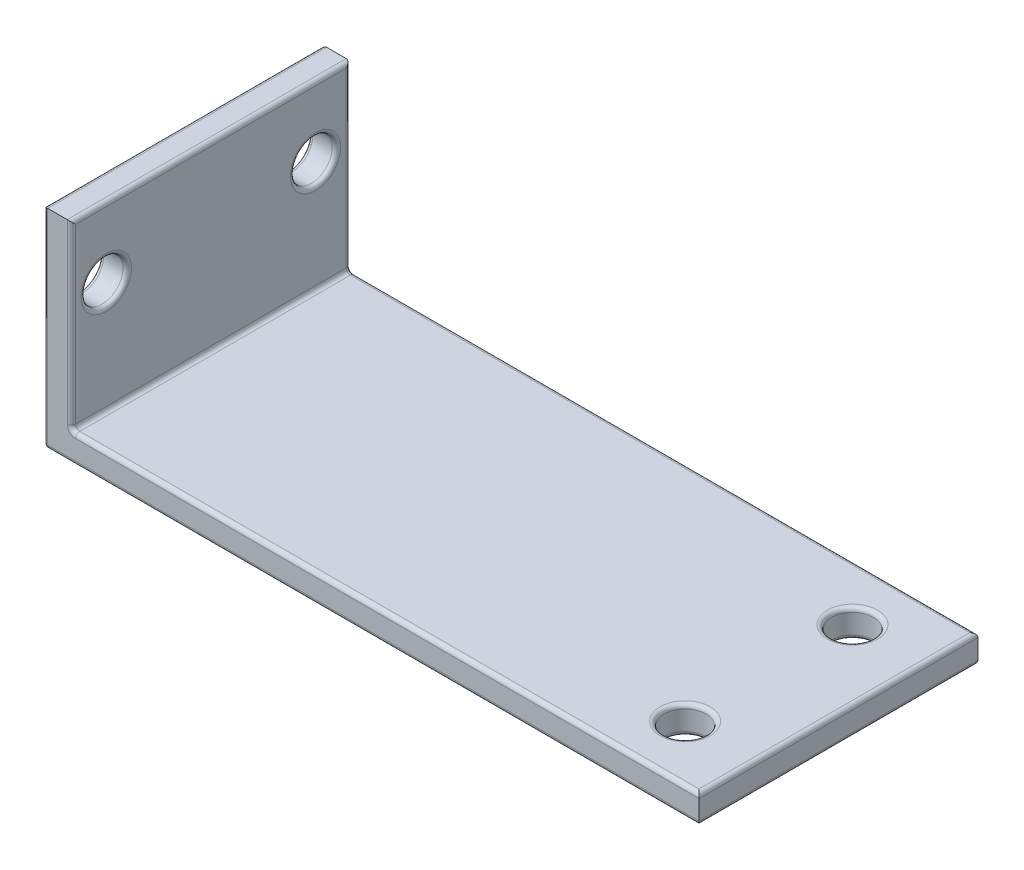
ISO-10303-21;
HEADER;
FILE_DESCRIPTION(('STEP AP214'),'2;1');
FILE_NAME('part.step','',(''),(''),'','','');
FILE_SCHEMA(('AUTOMOTIVE_DESIGN { 1 0 10303 214 1 1 1 1 }'));
ENDSEC;
DATA;
#1=APPLICATION_CONTEXT('core data for automotive mechanical design processes');
#2=APPLICATION_PROTOCOL_DEFINITION('international standard','automotive_design',2000,#1);
#3=PRODUCT_CONTEXT('',#1,'mechanical');
#4=PRODUCT('Part','Part','',(#3));
#5=PRODUCT_RELATED_PRODUCT_CATEGORY('part','',(#4));
#6=PRODUCT_DEFINITION_FORMATION('','',#4);
#7=PRODUCT_DEFINITION_CONTEXT('part definition',#1,'design');
#8=PRODUCT_DEFINITION('design','',#6,#7);
#9=PRODUCT_DEFINITION_SHAPE('','',#8);
#10=(LENGTH_UNIT() NAMED_UNIT(*) SI_UNIT(.MILLI.,.METRE.));
#11=(NAMED_UNIT(*) PLANE_ANGLE_UNIT() SI_UNIT($,.RADIAN.));
#12=(NAMED_UNIT(*) SI_UNIT($,.STERADIAN.) SOLID_ANGLE_UNIT());
#13=UNCERTAINTY_MEASURE_WITH_UNIT(LENGTH_MEASURE(1.E-05),#10,'distance_accuracy_value','');
#14=(GEOMETRIC_REPRESENTATION_CONTEXT(3) GLOBAL_UNCERTAINTY_ASSIGNED_CONTEXT((#13)) GLOBAL_UNIT_ASSIGNED_CONTEXT((#10,
#11,#12)) REPRESENTATION_CONTEXT('',''));
#15=CARTESIAN_POINT('',(0.,0.,0.));
#16=DIRECTION('',(0.,0.,1.));
#17=DIRECTION('',(1.,0.,0.));
#18=AXIS2_PLACEMENT_3D('',#15,#16,#17);
#19=CARTESIAN_POINT('',(0.,15.,10.));
#20=DIRECTION('',(1.,0.,0.));
#21=DIRECTION('',(0.,0.,-1.));
#22=AXIS2_PLACEMENT_3D('',#19,#20,#21);
#23=PLANE('',#22);
#24=DIRECTION('',(0.,-1.,0.));
#25=VECTOR('',#24,1.);
#26=CARTESIAN_POINT('',(0.,15.,9.7));
#27=LINE('',#26,#25);
#28=CARTESIAN_POINT('',(0.,0.3,9.7));
#29=VERTEX_POINT('',#28);
#30=CARTESIAN_POINT('',(0.,14.7,9.7));
#31=VERTEX_POINT('',#30);
#32=EDGE_CURVE('E42',#29,#31,#27,.F.);
#33=ORIENTED_EDGE('',*,*,#32,.T.);
#34=DIRECTION('',(0.,0.,-1.));
#35=VECTOR('',#34,1.);
#36=CARTESIAN_POINT('',(0.,14.7,10.));
#37=LINE('',#36,#35);
#38=CARTESIAN_POINT('',(0.,14.7,-9.7));
#39=VERTEX_POINT('',#38);
#40=EDGE_CURVE('E11',#31,#39,#37,.T.);
#41=ORIENTED_EDGE('',*,*,#40,.T.);
#42=DIRECTION('',(0.,-1.,0.));
#43=VECTOR('',#42,1.);
#44=CARTESIAN_POINT('',(0.,15.,-9.7));
#45=LINE('',#44,#43);
#46=CARTESIAN_POINT('',(0.,0.3,-9.7));
#47=VERTEX_POINT('',#46);
#48=EDGE_CURVE('E282',#39,#47,#45,.T.);
#49=ORIENTED_EDGE('',*,*,#48,.T.);
#50=DIRECTION('',(0.,0.,-1.));
#51=VECTOR('',#50,1.);
#52=CARTESIAN_POINT('',(0.,0.3,10.));
#53=LINE('',#52,#51);
#54=EDGE_CURVE('E53',#47,#29,#53,.F.);
#55=ORIENTED_EDGE('',*,*,#54,.T.);
#56=EDGE_LOOP('',(#33,#41,#49,#55));
#57=FACE_BOUND('',#56,.T.);
#58=CARTESIAN_POINT('',(0.,10.,-7.50000000000007));
#59=DIRECTION('',(1.,0.,0.));
#60=DIRECTION('',(0.,0.,-1.));
#61=AXIS2_PLACEMENT_3D('',#58,#59,#60);
#62=CIRCLE('',#61,1.80000000000001);
#63=CARTESIAN_POINT('',(0.,10.,-9.30000000000007));
#64=VERTEX_POINT('',#63);
#65=EDGE_CURVE('E279',#64,#64,#62,.T.);
#66=ORIENTED_EDGE('',*,*,#65,.T.);
#67=EDGE_LOOP('',(#66));
#68=FACE_BOUND('',#67,.T.);
#69=CARTESIAN_POINT('',(0.,10.,7.5));
#70=DIRECTION('',(1.,0.,0.));
#71=DIRECTION('',(0.,0.,-1.));
#72=AXIS2_PLACEMENT_3D('',#69,#70,#71);
#73=CIRCLE('',#72,1.8);
#74=CARTESIAN_POINT('',(0.,10.,5.7));
#75=VERTEX_POINT('',#74);
#76=EDGE_CURVE('E276',#75,#75,#73,.T.);
#77=ORIENTED_EDGE('',*,*,#76,.T.);
#78=EDGE_LOOP('',(#77));
#79=FACE_BOUND('',#78,.T.);
#80=ADVANCED_FACE('F33',(#57,#68,#79),#23,.F.);
#81=CARTESIAN_POINT('',(0.,0.,10.));
#82=DIRECTION('',(0.,1.,0.));
#83=DIRECTION('',(0.,0.,1.));
#84=AXIS2_PLACEMENT_3D('',#81,#82,#83);
#85=PLANE('',#84);
#86=CARTESIAN_POINT('',(42.,0.,-6.));
#87=DIRECTION('',(0.,1.,0.));
#88=DIRECTION('',(0.,0.,1.));
#89=AXIS2_PLACEMENT_3D('',#86,#87,#88);
#90=CIRCLE('',#89,1.8);
#91=CARTESIAN_POINT('',(42.,0.,-4.2));
#92=VERTEX_POINT('',#91);
#93=EDGE_CURVE('E273',#92,#92,#90,.T.);
#94=ORIENTED_EDGE('',*,*,#93,.T.);
#95=EDGE_LOOP('',(#94));
#96=FACE_BOUND('',#95,.T.);
#97=CARTESIAN_POINT('',(42.,0.,6.));
#98=DIRECTION('',(0.,1.,0.));
#99=DIRECTION('',(0.,0.,1.));
#100=AXIS2_PLACEMENT_3D('',#97,#98,#99);
#101=CIRCLE('',#100,1.8);
#102=CARTESIAN_POINT('',(42.,0.,7.8));
#103=VERTEX_POINT('',#102);
#104=EDGE_CURVE('E270',#103,#103,#101,.T.);
#105=ORIENTED_EDGE('',*,*,#104,.T.);
#106=EDGE_LOOP('',(#105));
#107=FACE_BOUND('',#106,.T.);
#108=DIRECTION('',(0.,0.,-1.));
#109=VECTOR('',#108,1.);
#110=CARTESIAN_POINT('',(46.7,0.,10.));
#111=LINE('',#110,#109);
#112=CARTESIAN_POINT('',(46.7,0.,-9.7));
#113=VERTEX_POINT('',#112);
#114=CARTESIAN_POINT('',(46.7,0.,9.7));
#115=VERTEX_POINT('',#114);
#116=EDGE_CURVE('E267',#113,#115,#111,.F.);
#117=ORIENTED_EDGE('',*,*,#116,.T.);
#118=DIRECTION('',(1.,0.,0.));
#119=VECTOR('',#118,1.);
#120=CARTESIAN_POINT('',(0.,0.,9.7));
#121=LINE('',#120,#119);
#122=CARTESIAN_POINT('',(0.3,0.,9.7));
#123=VERTEX_POINT('',#122);
#124=EDGE_CURVE('E146',#115,#123,#121,.F.);
#125=ORIENTED_EDGE('',*,*,#124,.T.);
#126=DIRECTION('',(0.,0.,-1.));
#127=VECTOR('',#126,1.);
#128=CARTESIAN_POINT('',(0.3,0.,10.));
#129=LINE('',#128,#127);
#130=CARTESIAN_POINT('',(0.3,0.,-9.7));
#131=VERTEX_POINT('',#130);
#132=EDGE_CURVE('E263',#123,#131,#129,.T.);
#133=ORIENTED_EDGE('',*,*,#132,.T.);
#134=DIRECTION('',(1.,0.,0.));
#135=VECTOR('',#134,1.);
#136=CARTESIAN_POINT('',(0.,0.,-9.7));
#137=LINE('',#136,#135);
#138=EDGE_CURVE('E265',#131,#113,#137,.T.);
#139=ORIENTED_EDGE('',*,*,#138,.T.);
#140=EDGE_LOOP('',(#117,#125,#133,#139));
#141=FACE_BOUND('',#140,.T.);
#142=ADVANCED_FACE('F345',(#96,#107,#141),#85,.F.);
#143=CARTESIAN_POINT('',(47.,0.,10.));
#144=DIRECTION('',(-1.,0.,0.));
#145=DIRECTION('',(0.,0.,1.));
#146=AXIS2_PLACEMENT_3D('',#143,#144,#145);
#147=PLANE('',#146);
#148=DIRECTION('',(0.,1.,0.));
#149=VECTOR('',#148,1.);
#150=CARTESIAN_POINT('',(47.,0.,-10.));
#151=LINE('',#150,#149);
#152=CARTESIAN_POINT('',(47.,0.3,-10.));
#153=VERTEX_POINT('',#152);
#154=CARTESIAN_POINT('',(47.,1.7,-10.));
#155=VERTEX_POINT('',#154);
#156=EDGE_CURVE('E181',#153,#155,#151,.T.);
#157=ORIENTED_EDGE('',*,*,#156,.T.);
#158=DIRECTION('',(0.,0.,-1.));
#159=VECTOR('',#158,1.);
#160=CARTESIAN_POINT('',(47.,1.7,10.));
#161=LINE('',#160,#159);
#162=CARTESIAN_POINT('',(47.,1.7,10.));
#163=VERTEX_POINT('',#162);
#164=EDGE_CURVE('E160',#155,#163,#161,.F.);
#165=ORIENTED_EDGE('',*,*,#164,.T.);
#166=DIRECTION('',(0.,1.,0.));
#167=VECTOR('',#166,1.);
#168=CARTESIAN_POINT('',(47.,0.,10.));
#169=LINE('',#168,#167);
#170=CARTESIAN_POINT('',(47.,0.3,10.));
#171=VERTEX_POINT('',#170);
#172=EDGE_CURVE('E166',#171,#163,#169,.T.);
#173=ORIENTED_EDGE('',*,*,#172,.F.);
#174=DIRECTION('',(0.,0.,-1.));
#175=VECTOR('',#174,1.);
#176=CARTESIAN_POINT('',(47.,0.3,10.));
#177=LINE('',#176,#175);
#178=EDGE_CURVE('E152',#171,#153,#177,.T.);
#179=ORIENTED_EDGE('',*,*,#178,.T.);
#180=EDGE_LOOP('',(#157,#165,#173,#179));
#181=FACE_BOUND('',#180,.T.);
#182=ADVANCED_FACE('F174',(#181),#147,.F.);
#183=CARTESIAN_POINT('',(47.,2.,10.));
#184=DIRECTION('',(0.,-1.,0.));
#185=DIRECTION('',(1.,0.,0.));
#186=AXIS2_PLACEMENT_3D('',#183,#184,#185);
#187=PLANE('',#186);
#188=DIRECTION('',(-1.,0.,0.));
#189=VECTOR('',#188,1.);
#190=CARTESIAN_POINT('',(47.,2.,9.7));
#191=LINE('',#190,#189);
#192=CARTESIAN_POINT('',(2.3,1.99999999999999,9.7));
#193=VERTEX_POINT('',#192);
#194=CARTESIAN_POINT('',(46.7,2.,9.7));
#195=VERTEX_POINT('',#194);
#196=EDGE_CURVE('E246',#193,#195,#191,.F.);
#197=ORIENTED_EDGE('',*,*,#196,.T.);
#198=DIRECTION('',(0.,0.,-1.));
#199=VECTOR('',#198,1.);
#200=CARTESIAN_POINT('',(46.7,2.,10.));
#201=LINE('',#200,#199);
#202=CARTESIAN_POINT('',(46.7,2.,-9.7));
#203=VERTEX_POINT('',#202);
#204=EDGE_CURVE('E161',#195,#203,#201,.T.);
#205=ORIENTED_EDGE('',*,*,#204,.T.);
#206=DIRECTION('',(-1.,0.,0.));
#207=VECTOR('',#206,1.);
#208=CARTESIAN_POINT('',(47.,2.,-9.7));
#209=LINE('',#208,#207);
#210=CARTESIAN_POINT('',(2.3,1.99999999999999,-9.7));
#211=VERTEX_POINT('',#210);
#212=EDGE_CURVE('E242',#203,#211,#209,.T.);
#213=ORIENTED_EDGE('',*,*,#212,.T.);
#214=DIRECTION('',(0.,0.,-1.));
#215=VECTOR('',#214,1.);
#216=CARTESIAN_POINT('',(2.3,1.99999999999999,10.));
#217=LINE('',#216,#215);
#218=EDGE_CURVE('E244',#211,#193,#217,.F.);
#219=ORIENTED_EDGE('',*,*,#218,.T.);
#220=EDGE_LOOP('',(#197,#205,#213,#219));
#221=FACE_BOUND('',#220,.T.);
#222=CARTESIAN_POINT('',(42.,2.,-6.));
#223=DIRECTION('',(0.,-1.,0.));
#224=DIRECTION('',(1.,0.,0.));
#225=AXIS2_PLACEMENT_3D('',#222,#223,#224);
#226=CIRCLE('',#225,1.8);
#227=CARTESIAN_POINT('',(43.8,2.,-6.));
#228=VERTEX_POINT('',#227);
#229=EDGE_CURVE('E239',#228,#228,#226,.T.);
#230=ORIENTED_EDGE('',*,*,#229,.T.);
#231=EDGE_LOOP('',(#230));
#232=FACE_BOUND('',#231,.T.);
#233=CARTESIAN_POINT('',(42.,2.,6.));
#234=DIRECTION('',(0.,-1.,0.));
#235=DIRECTION('',(1.,0.,0.));
#236=AXIS2_PLACEMENT_3D('',#233,#234,#235);
#237=CIRCLE('',#236,1.8);
#238=CARTESIAN_POINT('',(43.8,2.,6.));
#239=VERTEX_POINT('',#238);
#240=EDGE_CURVE('E236',#239,#239,#237,.T.);
#241=ORIENTED_EDGE('',*,*,#240,.T.);
#242=EDGE_LOOP('',(#241));
#243=FACE_BOUND('',#242,.T.);
#244=ADVANCED_FACE('F386',(#221,#232,#243),#187,.F.);
#245=CARTESIAN_POINT('',(2.,1.99999999999999,10.));
#246=DIRECTION('',(-1.,0.,0.));
#247=DIRECTION('',(0.,-1.,0.));
#248=AXIS2_PLACEMENT_3D('',#245,#246,#247);
#249=PLANE('',#248);
#250=CARTESIAN_POINT('',(2.,10.,-7.50000000000007));
#251=DIRECTION('',(-1.,0.,0.));
#252=DIRECTION('',(0.,-1.,0.));
#253=AXIS2_PLACEMENT_3D('',#250,#251,#252);
#254=CIRCLE('',#253,1.80000000000001);
#255=CARTESIAN_POINT('',(2.,8.2,-7.50000000000007));
#256=VERTEX_POINT('',#255);
#257=EDGE_CURVE('E206',#256,#256,#254,.T.);
#258=ORIENTED_EDGE('',*,*,#257,.T.);
#259=EDGE_LOOP('',(#258));
#260=FACE_BOUND('',#259,.T.);
#261=CARTESIAN_POINT('',(2.,10.,7.5));
#262=DIRECTION('',(-1.,0.,0.));
#263=DIRECTION('',(0.,-1.,0.));
#264=AXIS2_PLACEMENT_3D('',#261,#262,#263);
#265=CIRCLE('',#264,1.8);
#266=CARTESIAN_POINT('',(2.,8.20000000000001,7.5));
#267=VERTEX_POINT('',#266);
#268=EDGE_CURVE('E203',#267,#267,#265,.T.);
#269=ORIENTED_EDGE('',*,*,#268,.T.);
#270=EDGE_LOOP('',(#269));
#271=FACE_BOUND('',#270,.T.);
#272=DIRECTION('',(0.,0.,-1.));
#273=VECTOR('',#272,1.);
#274=CARTESIAN_POINT('',(2.,14.7,10.));
#275=LINE('',#274,#273);
#276=CARTESIAN_POINT('',(2.,14.7,-9.7));
#277=VERTEX_POINT('',#276);
#278=CARTESIAN_POINT('',(2.,14.7,9.7));
#279=VERTEX_POINT('',#278);
#280=EDGE_CURVE('E198',#277,#279,#275,.F.);
#281=ORIENTED_EDGE('',*,*,#280,.T.);
#282=DIRECTION('',(0.,1.,0.));
#283=VECTOR('',#282,1.);
#284=CARTESIAN_POINT('',(2.,1.99999999999999,9.7));
#285=LINE('',#284,#283);
#286=CARTESIAN_POINT('',(2.,2.29999999999999,9.7));
#287=VERTEX_POINT('',#286);
#288=EDGE_CURVE('E200',#279,#287,#285,.F.);
#289=ORIENTED_EDGE('',*,*,#288,.T.);
#290=DIRECTION('',(0.,0.,-1.));
#291=VECTOR('',#290,1.);
#292=CARTESIAN_POINT('',(2.,2.29999999999999,-10.));
#293=LINE('',#292,#291);
#294=CARTESIAN_POINT('',(2.,2.29999999999999,-9.7));
#295=VERTEX_POINT('',#294);
#296=EDGE_CURVE('E194',#287,#295,#293,.T.);
#297=ORIENTED_EDGE('',*,*,#296,.T.);
#298=DIRECTION('',(0.,1.,0.));
#299=VECTOR('',#298,1.);
#300=CARTESIAN_POINT('',(2.,1.99999999999999,-9.7));
#301=LINE('',#300,#299);
#302=EDGE_CURVE('E196',#295,#277,#301,.T.);
#303=ORIENTED_EDGE('',*,*,#302,.T.);
#304=EDGE_LOOP('',(#281,#289,#297,#303));
#305=FACE_BOUND('',#304,.T.);
#306=ADVANCED_FACE('F382',(#260,#271,#305),#249,.F.);
#307=CARTESIAN_POINT('',(2.,15.,10.));
#308=DIRECTION('',(0.,-1.,0.));
#309=DIRECTION('',(0.,0.,-1.));
#310=AXIS2_PLACEMENT_3D('',#307,#308,#309);
#311=PLANE('',#310);
#312=DIRECTION('',(-1.,0.,0.));
#313=VECTOR('',#312,1.);
#314=CARTESIAN_POINT('',(2.,15.,10.));
#315=LINE('',#314,#313);
#316=CARTESIAN_POINT('',(1.7,15.,10.));
#317=VERTEX_POINT('',#316);
#318=CARTESIAN_POINT('',(0.3,15.,10.));
#319=VERTEX_POINT('',#318);
#320=EDGE_CURVE('E176',#317,#319,#315,.T.);
#321=ORIENTED_EDGE('',*,*,#320,.F.);
#322=DIRECTION('',(0.,0.,-1.));
#323=VECTOR('',#322,1.);
#324=CARTESIAN_POINT('',(1.7,15.,10.));
#325=LINE('',#324,#323);
#326=CARTESIAN_POINT('',(1.7,15.,-10.));
#327=VERTEX_POINT('',#326);
#328=EDGE_CURVE('E211',#317,#327,#325,.T.);
#329=ORIENTED_EDGE('',*,*,#328,.T.);
#330=DIRECTION('',(-1.,0.,0.));
#331=VECTOR('',#330,1.);
#332=CARTESIAN_POINT('',(2.,15.,-10.));
#333=LINE('',#332,#331);
#334=CARTESIAN_POINT('',(0.3,15.,-10.));
#335=VERTEX_POINT('',#334);
#336=EDGE_CURVE('E177',#327,#335,#333,.T.);
#337=ORIENTED_EDGE('',*,*,#336,.T.);
#338=DIRECTION('',(0.,0.,-1.));
#339=VECTOR('',#338,1.);
#340=CARTESIAN_POINT('',(0.3,15.,10.));
#341=LINE('',#340,#339);
#342=EDGE_CURVE('E209',#335,#319,#341,.F.);
#343=ORIENTED_EDGE('',*,*,#342,.T.);
#344=EDGE_LOOP('',(#321,#329,#337,#343));
#345=FACE_BOUND('',#344,.T.);
#346=ADVANCED_FACE('F376',(#345),#311,.F.);
#347=CARTESIAN_POINT('',(0.,0.,10.));
#348=DIRECTION('',(0.,0.,1.));
#349=DIRECTION('',(1.,0.,0.));
#350=AXIS2_PLACEMENT_3D('',#347,#348,#349);
#351=PLANE('',#350);
#352=CARTESIAN_POINT('',(2.3,2.29999999999999,10.));
#353=DIRECTION('',(0.,0.,1.));
#354=DIRECTION('',(1.,0.,0.));
#355=AXIS2_PLACEMENT_3D('',#352,#353,#354);
#356=CIRCLE('',#355,0.6);
#357=CARTESIAN_POINT('',(1.7,2.29999999999999,10.));
#358=VERTEX_POINT('',#357);
#359=CARTESIAN_POINT('',(2.3,1.69999999999999,10.));
#360=VERTEX_POINT('',#359);
#361=EDGE_CURVE('E172',#358,#360,#356,.T.);
#362=ORIENTED_EDGE('',*,*,#361,.F.);
#363=DIRECTION('',(0.,1.,0.));
#364=VECTOR('',#363,1.);
#365=CARTESIAN_POINT('',(1.7,15.,10.));
#366=LINE('',#365,#364);
#367=EDGE_CURVE('E191',#358,#317,#366,.T.);
#368=ORIENTED_EDGE('',*,*,#367,.T.);
#369=ORIENTED_EDGE('',*,*,#320,.T.);
#370=DIRECTION('',(0.,-1.,0.));
#371=VECTOR('',#370,1.);
#372=CARTESIAN_POINT('',(0.3,0.,10.));
#373=LINE('',#372,#371);
#374=CARTESIAN_POINT('',(0.3,0.3,10.));
#375=VERTEX_POINT('',#374);
#376=EDGE_CURVE('E170',#319,#375,#373,.T.);
#377=ORIENTED_EDGE('',*,*,#376,.T.);
#378=DIRECTION('',(1.,0.,0.));
#379=VECTOR('',#378,1.);
#380=CARTESIAN_POINT('',(47.,0.3,10.));
#381=LINE('',#380,#379);
#382=EDGE_CURVE('E144',#375,#171,#381,.T.);
#383=ORIENTED_EDGE('',*,*,#382,.T.);
#384=ORIENTED_EDGE('',*,*,#172,.T.);
#385=DIRECTION('',(-1.,0.,0.));
#386=VECTOR('',#385,1.);
#387=CARTESIAN_POINT('',(2.,1.69999999999999,10.));
#388=LINE('',#387,#386);
#389=EDGE_CURVE('E189',#163,#360,#388,.T.);
#390=ORIENTED_EDGE('',*,*,#389,.T.);
#391=EDGE_LOOP('',(#362,#368,#369,#377,#383,#384,#390));
#392=FACE_BOUND('',#391,.T.);
#393=ADVANCED_FACE('F165',(#392),#351,.T.);
#394=CARTESIAN_POINT('',(0.,0.,-10.));
#395=DIRECTION('',(0.,0.,1.));
#396=DIRECTION('',(1.,0.,0.));
#397=AXIS2_PLACEMENT_3D('',#394,#395,#396);
#398=PLANE('',#397);
#399=ORIENTED_EDGE('',*,*,#336,.F.);
#400=DIRECTION('',(0.,1.,0.));
#401=VECTOR('',#400,1.);
#402=CARTESIAN_POINT('',(1.7,0.,-10.));
#403=LINE('',#402,#401);
#404=CARTESIAN_POINT('',(1.7,2.29999999999999,-10.));
#405=VERTEX_POINT('',#404);
#406=EDGE_CURVE('E222',#327,#405,#403,.F.);
#407=ORIENTED_EDGE('',*,*,#406,.T.);
#408=CARTESIAN_POINT('',(2.3,2.29999999999999,-10.));
#409=DIRECTION('',(0.,0.,1.));
#410=DIRECTION('',(1.,0.,0.));
#411=AXIS2_PLACEMENT_3D('',#408,#409,#410);
#412=CIRCLE('',#411,0.6);
#413=CARTESIAN_POINT('',(2.3,1.69999999999999,-10.));
#414=VERTEX_POINT('',#413);
#415=EDGE_CURVE('E219',#414,#405,#412,.F.);
#416=ORIENTED_EDGE('',*,*,#415,.F.);
#417=DIRECTION('',(-1.,0.,0.));
#418=VECTOR('',#417,1.);
#419=CARTESIAN_POINT('',(0.,1.69999999999999,-10.));
#420=LINE('',#419,#418);
#421=EDGE_CURVE('E217',#414,#155,#420,.F.);
#422=ORIENTED_EDGE('',*,*,#421,.T.);
#423=ORIENTED_EDGE('',*,*,#156,.F.);
#424=DIRECTION('',(1.,0.,0.));
#425=VECTOR('',#424,1.);
#426=CARTESIAN_POINT('',(0.,0.3,-10.));
#427=LINE('',#426,#425);
#428=CARTESIAN_POINT('',(0.3,0.3,-10.));
#429=VERTEX_POINT('',#428);
#430=EDGE_CURVE('E215',#153,#429,#427,.F.);
#431=ORIENTED_EDGE('',*,*,#430,.T.);
#432=DIRECTION('',(0.,-1.,0.));
#433=VECTOR('',#432,1.);
#434=CARTESIAN_POINT('',(0.3,0.,-10.));
#435=LINE('',#434,#433);
#436=EDGE_CURVE('E213',#429,#335,#435,.F.);
#437=ORIENTED_EDGE('',*,*,#436,.T.);
#438=EDGE_LOOP('',(#399,#407,#416,#422,#423,#431,#437));
#439=FACE_BOUND('',#438,.T.);
#440=ADVANCED_FACE('F369',(#439),#398,.F.);
#441=CARTESIAN_POINT('',(47.,10.,-7.50000000000007));
#442=DIRECTION('',(-1.,0.,0.));
#443=DIRECTION('',(0.,0.,1.));
#444=AXIS2_PLACEMENT_3D('',#441,#442,#443);
#445=CYLINDRICAL_SURFACE('',#444,1.50000000000001);
#446=CARTESIAN_POINT('',(1.7,10.,-7.50000000000007));
#447=DIRECTION('',(-1.,0.,0.));
#448=DIRECTION('',(0.,-1.,0.));
#449=AXIS2_PLACEMENT_3D('',#446,#447,#448);
#450=CIRCLE('',#449,1.50000000000001);
#451=CARTESIAN_POINT('',(1.7,8.5,-7.50000000000007));
#452=VERTEX_POINT('',#451);
#453=EDGE_CURVE('E227',#452,#452,#450,.F.);
#454=ORIENTED_EDGE('',*,*,#453,.T.);
#455=EDGE_LOOP('',(#454));
#456=FACE_BOUND('',#455,.T.);
#457=CARTESIAN_POINT('',(0.300000000000002,10.,-7.50000000000007));
#458=DIRECTION('',(1.,0.,0.));
#459=DIRECTION('',(0.,0.,-1.));
#460=AXIS2_PLACEMENT_3D('',#457,#458,#459);
#461=CIRCLE('',#460,1.50000000000001);
#462=CARTESIAN_POINT('',(0.300000000000002,10.,-9.00000000000007));
#463=VERTEX_POINT('',#462);
#464=EDGE_CURVE('E224',#463,#463,#461,.F.);
#465=ORIENTED_EDGE('',*,*,#464,.T.);
#466=EDGE_LOOP('',(#465));
#467=FACE_BOUND('',#466,.T.);
#468=ADVANCED_FACE('F359',(#456,#467),#445,.F.);
#469=CARTESIAN_POINT('',(47.,10.,7.5));
#470=DIRECTION('',(-1.,0.,0.));
#471=DIRECTION('',(0.,0.,1.));
#472=AXIS2_PLACEMENT_3D('',#469,#470,#471);
#473=CYLINDRICAL_SURFACE('',#472,1.5);
#474=CARTESIAN_POINT('',(1.7,10.,7.5));
#475=DIRECTION('',(-1.,0.,0.));
#476=DIRECTION('',(0.,-1.,0.));
#477=AXIS2_PLACEMENT_3D('',#474,#475,#476);
#478=CIRCLE('',#477,1.5);
#479=CARTESIAN_POINT('',(1.7,8.50000000000001,7.5));
#480=VERTEX_POINT('',#479);
#481=EDGE_CURVE('E233',#480,#480,#478,.F.);
#482=ORIENTED_EDGE('',*,*,#481,.T.);
#483=EDGE_LOOP('',(#482));
#484=FACE_BOUND('',#483,.T.);
#485=CARTESIAN_POINT('',(0.300000000000002,10.,7.5));
#486=DIRECTION('',(1.,0.,0.));
#487=DIRECTION('',(0.,0.,-1.));
#488=AXIS2_PLACEMENT_3D('',#485,#486,#487);
#489=CIRCLE('',#488,1.5);
#490=CARTESIAN_POINT('',(0.300000000000002,10.,6.));
#491=VERTEX_POINT('',#490);
#492=EDGE_CURVE('E230',#491,#491,#489,.F.);
#493=ORIENTED_EDGE('',*,*,#492,.T.);
#494=EDGE_LOOP('',(#493));
#495=FACE_BOUND('',#494,.T.);
#496=ADVANCED_FACE('F356',(#484,#495),#473,.F.);
#497=CARTESIAN_POINT('',(42.,15.,-6.));
#498=DIRECTION('',(0.,-1.,0.));
#499=DIRECTION('',(0.,0.,-1.));
#500=AXIS2_PLACEMENT_3D('',#497,#498,#499);
#501=CYLINDRICAL_SURFACE('',#500,1.5);
#502=CARTESIAN_POINT('',(42.,1.7,-6.));
#503=DIRECTION('',(0.,-1.,0.));
#504=DIRECTION('',(1.,0.,0.));
#505=AXIS2_PLACEMENT_3D('',#502,#503,#504);
#506=CIRCLE('',#505,1.5);
#507=CARTESIAN_POINT('',(43.5,1.7,-6.));
#508=VERTEX_POINT('',#507);
#509=EDGE_CURVE('E254',#508,#508,#506,.F.);
#510=ORIENTED_EDGE('',*,*,#509,.T.);
#511=EDGE_LOOP('',(#510));
#512=FACE_BOUND('',#511,.T.);
#513=CARTESIAN_POINT('',(42.,0.3,-6.));
#514=DIRECTION('',(0.,1.,0.));
#515=DIRECTION('',(0.,0.,1.));
#516=AXIS2_PLACEMENT_3D('',#513,#514,#515);
#517=CIRCLE('',#516,1.5);
#518=CARTESIAN_POINT('',(42.,0.3,-4.5));
#519=VERTEX_POINT('',#518);
#520=EDGE_CURVE('E251',#519,#519,#517,.F.);
#521=ORIENTED_EDGE('',*,*,#520,.T.);
#522=EDGE_LOOP('',(#521));
#523=FACE_BOUND('',#522,.T.);
#524=ADVANCED_FACE('F358',(#512,#523),#501,.F.);
#525=CARTESIAN_POINT('',(42.,15.,6.));
#526=DIRECTION('',(0.,-1.,0.));
#527=DIRECTION('',(0.,0.,-1.));
#528=AXIS2_PLACEMENT_3D('',#525,#526,#527);
#529=CYLINDRICAL_SURFACE('',#528,1.5);
#530=CARTESIAN_POINT('',(42.,1.7,6.));
#531=DIRECTION('',(0.,-1.,0.));
#532=DIRECTION('',(1.,0.,0.));
#533=AXIS2_PLACEMENT_3D('',#530,#531,#532);
#534=CIRCLE('',#533,1.5);
#535=CARTESIAN_POINT('',(43.5,1.7,6.));
#536=VERTEX_POINT('',#535);
#537=EDGE_CURVE('E260',#536,#536,#534,.F.);
#538=ORIENTED_EDGE('',*,*,#537,.T.);
#539=EDGE_LOOP('',(#538));
#540=FACE_BOUND('',#539,.T.);
#541=CARTESIAN_POINT('',(42.,0.3,6.));
#542=DIRECTION('',(0.,1.,0.));
#543=DIRECTION('',(0.,0.,1.));
#544=AXIS2_PLACEMENT_3D('',#541,#542,#543);
#545=CIRCLE('',#544,1.5);
#546=CARTESIAN_POINT('',(42.,0.3,7.5));
#547=VERTEX_POINT('',#546);
#548=EDGE_CURVE('E257',#547,#547,#545,.F.);
#549=ORIENTED_EDGE('',*,*,#548,.T.);
#550=EDGE_LOOP('',(#549));
#551=FACE_BOUND('',#550,.T.);
#552=ADVANCED_FACE('F366',(#540,#551),#529,.F.);
#553=CARTESIAN_POINT('',(47.,1.7,-9.7));
#554=DIRECTION('',(-1.,0.,0.));
#555=DIRECTION('',(0.,-1.,0.));
#556=AXIS2_PLACEMENT_3D('',#553,#554,#555);
#557=CYLINDRICAL_SURFACE('',#556,0.3);
#558=CARTESIAN_POINT('',(2.3,1.69999999999999,-9.7));
#559=DIRECTION('',(-1.,0.,0.));
#560=DIRECTION('',(0.,0.,1.));
#561=AXIS2_PLACEMENT_3D('',#558,#559,#560);
#562=CIRCLE('',#561,0.3);
#563=EDGE_CURVE('E308',#211,#414,#562,.T.);
#564=ORIENTED_EDGE('',*,*,#563,.F.);
#565=ORIENTED_EDGE('',*,*,#212,.F.);
#566=CARTESIAN_POINT('',(46.7,1.7,-9.7));
#567=DIRECTION('',(-0.707106781186547,0.,-0.707106781186547));
#568=DIRECTION('',(-0.707106781186547,0.,0.707106781186547));
#569=AXIS2_PLACEMENT_3D('',#566,#567,#568);
#570=ELLIPSE('',#569,0.424264068711928,0.3);
#571=EDGE_CURVE('E184',#155,#203,#570,.F.);
#572=ORIENTED_EDGE('',*,*,#571,.F.);
#573=ORIENTED_EDGE('',*,*,#421,.F.);
#574=EDGE_LOOP('',(#564,#565,#572,#573));
#575=FACE_BOUND('',#574,.T.);
#576=ADVANCED_FACE('F428',(#575),#557,.T.);
#577=CARTESIAN_POINT('',(46.7,1.7,10.));
#578=DIRECTION('',(0.,0.,-1.));
#579=DIRECTION('',(-1.,0.,0.));
#580=AXIS2_PLACEMENT_3D('',#577,#578,#579);
#581=CYLINDRICAL_SURFACE('',#580,0.3);
#582=ORIENTED_EDGE('',*,*,#571,.T.);
#583=ORIENTED_EDGE('',*,*,#204,.F.);
#584=CARTESIAN_POINT('',(46.7,1.7,9.7));
#585=DIRECTION('',(0.707106781186547,0.,-0.707106781186547));
#586=DIRECTION('',(0.707106781186547,0.,0.707106781186547));
#587=AXIS2_PLACEMENT_3D('',#584,#585,#586);
#588=ELLIPSE('',#587,0.424264068711928,0.3);
#589=EDGE_CURVE('E302',#163,#195,#588,.F.);
#590=ORIENTED_EDGE('',*,*,#589,.F.);
#591=ORIENTED_EDGE('',*,*,#164,.F.);
#592=EDGE_LOOP('',(#582,#583,#590,#591));
#593=FACE_BOUND('',#592,.T.);
#594=ADVANCED_FACE('F424',(#593),#581,.T.);
#595=CARTESIAN_POINT('',(2.3,2.29999999999999,-9.7));
#596=DIRECTION('',(0.,0.,1.));
#597=DIRECTION('',(1.,0.,0.));
#598=AXIS2_PLACEMENT_3D('',#595,#596,#597);
#599=TOROIDAL_SURFACE('',#598,0.6,0.3);
#600=CARTESIAN_POINT('',(1.7,2.29999999999999,-9.7));
#601=DIRECTION('',(0.,-1.,0.));
#602=DIRECTION('',(0.,0.,-1.));
#603=AXIS2_PLACEMENT_3D('',#600,#601,#602);
#604=CIRCLE('',#603,0.3);
#605=EDGE_CURVE('E299',#295,#405,#604,.F.);
#606=ORIENTED_EDGE('',*,*,#605,.F.);
#607=CARTESIAN_POINT('',(2.3,2.29999999999999,-9.7));
#608=DIRECTION('',(0.,0.,1.));
#609=DIRECTION('',(1.,0.,0.));
#610=AXIS2_PLACEMENT_3D('',#607,#608,#609);
#611=CIRCLE('',#610,0.3);
#612=EDGE_CURVE('E305',#211,#295,#611,.F.);
#613=ORIENTED_EDGE('',*,*,#612,.F.);
#614=ORIENTED_EDGE('',*,*,#563,.T.);
#615=ORIENTED_EDGE('',*,*,#415,.T.);
#616=EDGE_LOOP('',(#606,#613,#614,#615));
#617=FACE_BOUND('',#616,.T.);
#618=ADVANCED_FACE('F420',(#617),#599,.T.);
#619=CARTESIAN_POINT('',(2.3,2.29999999999999,10.));
#620=DIRECTION('',(0.,0.,1.));
#621=DIRECTION('',(1.,0.,0.));
#622=AXIS2_PLACEMENT_3D('',#619,#620,#621);
#623=CYLINDRICAL_SURFACE('',#622,0.3);
#624=ORIENTED_EDGE('',*,*,#612,.T.);
#625=ORIENTED_EDGE('',*,*,#296,.F.);
#626=CARTESIAN_POINT('',(2.3,2.29999999999999,9.7));
#627=DIRECTION('',(0.,0.,1.));
#628=DIRECTION('',(1.,0.,0.));
#629=AXIS2_PLACEMENT_3D('',#626,#627,#628);
#630=CIRCLE('',#629,0.3);
#631=EDGE_CURVE('E296',#193,#287,#630,.F.);
#632=ORIENTED_EDGE('',*,*,#631,.F.);
#633=ORIENTED_EDGE('',*,*,#218,.F.);
#634=EDGE_LOOP('',(#624,#625,#632,#633));
#635=FACE_BOUND('',#634,.T.);
#636=ADVANCED_FACE('F416',(#635),#623,.F.);
#637=CARTESIAN_POINT('',(0.,1.69999999999999,9.7));
#638=DIRECTION('',(1.,0.,0.));
#639=DIRECTION('',(0.,1.,0.));
#640=AXIS2_PLACEMENT_3D('',#637,#638,#639);
#641=CYLINDRICAL_SURFACE('',#640,0.3);
#642=ORIENTED_EDGE('',*,*,#589,.T.);
#643=ORIENTED_EDGE('',*,*,#196,.F.);
#644=CARTESIAN_POINT('',(2.3,1.69999999999999,9.7));
#645=DIRECTION('',(-1.,0.,0.));
#646=DIRECTION('',(0.,0.,1.));
#647=AXIS2_PLACEMENT_3D('',#644,#645,#646);
#648=CIRCLE('',#647,0.3);
#649=EDGE_CURVE('E293',#360,#193,#648,.T.);
#650=ORIENTED_EDGE('',*,*,#649,.F.);
#651=ORIENTED_EDGE('',*,*,#389,.F.);
#652=EDGE_LOOP('',(#642,#643,#650,#651));
#653=FACE_BOUND('',#652,.T.);
#654=ADVANCED_FACE('F412',(#653),#641,.T.);
#655=CARTESIAN_POINT('',(1.7,1.99999999999999,-9.7));
#656=DIRECTION('',(0.,1.,0.));
#657=DIRECTION('',(-1.,0.,0.));
#658=AXIS2_PLACEMENT_3D('',#655,#656,#657);
#659=CYLINDRICAL_SURFACE('',#658,0.3);
#660=ORIENTED_EDGE('',*,*,#605,.T.);
#661=ORIENTED_EDGE('',*,*,#406,.F.);
#662=CARTESIAN_POINT('',(1.7,14.7,-9.7));
#663=DIRECTION('',(0.,0.707106781186547,0.707106781186547));
#664=DIRECTION('',(0.,0.707106781186547,-0.707106781186547));
#665=AXIS2_PLACEMENT_3D('',#662,#663,#664);
#666=ELLIPSE('',#665,0.424264068711928,0.3);
#667=EDGE_CURVE('E290',#277,#327,#666,.T.);
#668=ORIENTED_EDGE('',*,*,#667,.F.);
#669=ORIENTED_EDGE('',*,*,#302,.F.);
#670=EDGE_LOOP('',(#660,#661,#668,#669));
#671=FACE_BOUND('',#670,.T.);
#672=ADVANCED_FACE('F408',(#671),#659,.T.);
#673=CARTESIAN_POINT('',(2.3,2.29999999999999,9.7));
#674=DIRECTION('',(0.,0.,1.));
#675=DIRECTION('',(1.,0.,0.));
#676=AXIS2_PLACEMENT_3D('',#673,#674,#675);
#677=TOROIDAL_SURFACE('',#676,0.6,0.3);
#678=ORIENTED_EDGE('',*,*,#649,.T.);
#679=ORIENTED_EDGE('',*,*,#631,.T.);
#680=CARTESIAN_POINT('',(1.7,2.29999999999999,9.7));
#681=DIRECTION('',(0.,-1.,0.));
#682=DIRECTION('',(0.,0.,-1.));
#683=AXIS2_PLACEMENT_3D('',#680,#681,#682);
#684=CIRCLE('',#683,0.3);
#685=EDGE_CURVE('E288',#358,#287,#684,.F.);
#686=ORIENTED_EDGE('',*,*,#685,.F.);
#687=ORIENTED_EDGE('',*,*,#361,.T.);
#688=EDGE_LOOP('',(#678,#679,#686,#687));
#689=FACE_BOUND('',#688,.T.);
#690=ADVANCED_FACE('F404',(#689),#677,.T.);
#691=CARTESIAN_POINT('',(1.7,14.7,10.));
#692=DIRECTION('',(0.,0.,-1.));
#693=DIRECTION('',(-1.,0.,0.));
#694=AXIS2_PLACEMENT_3D('',#691,#692,#693);
#695=CYLINDRICAL_SURFACE('',#694,0.3);
#696=ORIENTED_EDGE('',*,*,#667,.T.);
#697=ORIENTED_EDGE('',*,*,#328,.F.);
#698=CARTESIAN_POINT('',(1.7,14.7,9.7));
#699=DIRECTION('',(0.,0.707106781186547,-0.707106781186547));
#700=DIRECTION('',(0.,-0.707106781186547,-0.707106781186547));
#701=AXIS2_PLACEMENT_3D('',#698,#699,#700);
#702=ELLIPSE('',#701,0.424264068711928,0.3);
#703=EDGE_CURVE('E286',#279,#317,#702,.F.);
#704=ORIENTED_EDGE('',*,*,#703,.F.);
#705=ORIENTED_EDGE('',*,*,#280,.F.);
#706=EDGE_LOOP('',(#696,#697,#704,#705));
#707=FACE_BOUND('',#706,.T.);
#708=ADVANCED_FACE('F400',(#707),#695,.T.);
#709=CARTESIAN_POINT('',(1.7,0.,9.7));
#710=DIRECTION('',(0.,-1.,0.));
#711=DIRECTION('',(1.,0.,0.));
#712=AXIS2_PLACEMENT_3D('',#709,#710,#711);
#713=CYLINDRICAL_SURFACE('',#712,0.3);
#714=ORIENTED_EDGE('',*,*,#685,.T.);
#715=ORIENTED_EDGE('',*,*,#288,.F.);
#716=ORIENTED_EDGE('',*,*,#703,.T.);
#717=ORIENTED_EDGE('',*,*,#367,.F.);
#718=EDGE_LOOP('',(#714,#715,#716,#717));
#719=FACE_BOUND('',#718,.T.);
#720=ADVANCED_FACE('F396',(#719),#713,.T.);
#721=CARTESIAN_POINT('',(1.7,10.,-7.50000000000007));
#722=DIRECTION('',(-1.,0.,0.));
#723=DIRECTION('',(0.,-1.,0.));
#724=AXIS2_PLACEMENT_3D('',#721,#722,#723);
#725=TOROIDAL_SURFACE('',#724,1.80000000000001,0.3);
#726=ORIENTED_EDGE('',*,*,#453,.F.);
#727=EDGE_LOOP('',(#726));
#728=FACE_BOUND('',#727,.T.);
#729=ORIENTED_EDGE('',*,*,#257,.F.);
#730=EDGE_LOOP('',(#729));
#731=FACE_BOUND('',#730,.T.);
#732=ADVANCED_FACE('F399',(#728,#731),#725,.T.);
#733=CARTESIAN_POINT('',(1.7,10.,7.5));
#734=DIRECTION('',(-1.,0.,0.));
#735=DIRECTION('',(0.,-1.,0.));
#736=AXIS2_PLACEMENT_3D('',#733,#734,#735);
#737=TOROIDAL_SURFACE('',#736,1.8,0.3);
#738=ORIENTED_EDGE('',*,*,#481,.F.);
#739=EDGE_LOOP('',(#738));
#740=FACE_BOUND('',#739,.T.);
#741=ORIENTED_EDGE('',*,*,#268,.F.);
#742=EDGE_LOOP('',(#741));
#743=FACE_BOUND('',#742,.T.);
#744=ADVANCED_FACE('F435',(#740,#743),#737,.T.);
#745=CARTESIAN_POINT('',(42.,1.7,-6.));
#746=DIRECTION('',(0.,-1.,0.));
#747=DIRECTION('',(1.,0.,0.));
#748=AXIS2_PLACEMENT_3D('',#745,#746,#747);
#749=TOROIDAL_SURFACE('',#748,1.8,0.3);
#750=ORIENTED_EDGE('',*,*,#509,.F.);
#751=EDGE_LOOP('',(#750));
#752=FACE_BOUND('',#751,.T.);
#753=ORIENTED_EDGE('',*,*,#229,.F.);
#754=EDGE_LOOP('',(#753));
#755=FACE_BOUND('',#754,.T.);
#756=ADVANCED_FACE('F439',(#752,#755),#749,.T.);
#757=CARTESIAN_POINT('',(42.,1.7,6.));
#758=DIRECTION('',(0.,-1.,0.));
#759=DIRECTION('',(1.,0.,0.));
#760=AXIS2_PLACEMENT_3D('',#757,#758,#759);
#761=TOROIDAL_SURFACE('',#760,1.8,0.3);
#762=ORIENTED_EDGE('',*,*,#537,.F.);
#763=EDGE_LOOP('',(#762));
#764=FACE_BOUND('',#763,.T.);
#765=ORIENTED_EDGE('',*,*,#240,.F.);
#766=EDGE_LOOP('',(#765));
#767=FACE_BOUND('',#766,.T.);
#768=ADVANCED_FACE('F443',(#764,#767),#761,.T.);
#769=CARTESIAN_POINT('',(0.3,15.,-9.7));
#770=DIRECTION('',(0.,-1.,0.));
#771=DIRECTION('',(0.,0.,-1.));
#772=AXIS2_PLACEMENT_3D('',#769,#770,#771);
#773=CYLINDRICAL_SURFACE('',#772,0.3);
#774=CARTESIAN_POINT('',(0.3,0.3,-9.7));
#775=DIRECTION('',(0.,-1.,0.));
#776=DIRECTION('',(0.,0.,-1.));
#777=AXIS2_PLACEMENT_3D('',#774,#775,#776);
#778=CIRCLE('',#777,0.3);
#779=EDGE_CURVE('E328',#47,#429,#778,.T.);
#780=ORIENTED_EDGE('',*,*,#779,.F.);
#781=ORIENTED_EDGE('',*,*,#48,.F.);
#782=CARTESIAN_POINT('',(0.3,14.7,-9.7));
#783=DIRECTION('',(0.,-0.707106781186547,-0.707106781186547));
#784=DIRECTION('',(0.,-0.707106781186547,0.707106781186547));
#785=AXIS2_PLACEMENT_3D('',#782,#783,#784);
#786=ELLIPSE('',#785,0.424264068711928,0.3);
#787=EDGE_CURVE('E37',#335,#39,#786,.F.);
#788=ORIENTED_EDGE('',*,*,#787,.F.);
#789=ORIENTED_EDGE('',*,*,#436,.F.);
#790=EDGE_LOOP('',(#780,#781,#788,#789));
#791=FACE_BOUND('',#790,.T.);
#792=ADVANCED_FACE('F342',(#791),#773,.T.);
#793=CARTESIAN_POINT('',(0.3,14.7,10.));
#794=DIRECTION('',(0.,0.,-1.));
#795=DIRECTION('',(-1.,0.,0.));
#796=AXIS2_PLACEMENT_3D('',#793,#794,#795);
#797=CYLINDRICAL_SURFACE('',#796,0.3);
#798=ORIENTED_EDGE('',*,*,#787,.T.);
#799=ORIENTED_EDGE('',*,*,#40,.F.);
#800=CARTESIAN_POINT('',(0.3,14.7,9.7));
#801=DIRECTION('',(0.,0.707106781186547,-0.707106781186547));
#802=DIRECTION('',(0.,0.707106781186547,0.707106781186547));
#803=AXIS2_PLACEMENT_3D('',#800,#801,#802);
#804=ELLIPSE('',#803,0.424264068711928,0.3);
#805=EDGE_CURVE('E323',#319,#31,#804,.F.);
#806=ORIENTED_EDGE('',*,*,#805,.F.);
#807=ORIENTED_EDGE('',*,*,#342,.F.);
#808=EDGE_LOOP('',(#798,#799,#806,#807));
#809=FACE_BOUND('',#808,.T.);
#810=ADVANCED_FACE('F338',(#809),#797,.T.);
#811=CARTESIAN_POINT('',(0.3,0.3,-9.7));
#812=DIRECTION('',(-1.,0.,0.));
#813=DIRECTION('',(0.,0.,1.));
#814=AXIS2_PLACEMENT_3D('',#811,#812,#813);
#815=SPHERICAL_SURFACE('',#814,0.3);
#816=CARTESIAN_POINT('',(0.3,0.3,-9.7));
#817=DIRECTION('',(-1.,0.,0.));
#818=DIRECTION('',(0.,0.,1.));
#819=AXIS2_PLACEMENT_3D('',#816,#817,#818);
#820=CIRCLE('',#819,0.3);
#821=EDGE_CURVE('E320',#131,#429,#820,.F.);
#822=ORIENTED_EDGE('',*,*,#821,.F.);
#823=CARTESIAN_POINT('',(0.3,0.3,-9.7));
#824=DIRECTION('',(0.,0.,-1.));
#825=DIRECTION('',(-1.,0.,0.));
#826=AXIS2_PLACEMENT_3D('',#823,#824,#825);
#827=CIRCLE('',#826,0.3);
#828=EDGE_CURVE('E326',#47,#131,#827,.F.);
#829=ORIENTED_EDGE('',*,*,#828,.F.);
#830=ORIENTED_EDGE('',*,*,#779,.T.);
#831=EDGE_LOOP('',(#822,#829,#830));
#832=FACE_BOUND('',#831,.T.);
#833=ADVANCED_FACE('F468',(#832),#815,.T.);
#834=CARTESIAN_POINT('',(0.3,0.3,10.));
#835=DIRECTION('',(0.,0.,-1.));
#836=DIRECTION('',(-1.,0.,0.));
#837=AXIS2_PLACEMENT_3D('',#834,#835,#836);
#838=CYLINDRICAL_SURFACE('',#837,0.3);
#839=ORIENTED_EDGE('',*,*,#828,.T.);
#840=ORIENTED_EDGE('',*,*,#132,.F.);
#841=CARTESIAN_POINT('',(0.3,0.3,9.7));
#842=DIRECTION('',(0.,0.,1.));
#843=DIRECTION('',(1.,0.,0.));
#844=AXIS2_PLACEMENT_3D('',#841,#842,#843);
#845=CIRCLE('',#844,0.3);
#846=EDGE_CURVE('E317',#29,#123,#845,.T.);
#847=ORIENTED_EDGE('',*,*,#846,.F.);
#848=ORIENTED_EDGE('',*,*,#54,.F.);
#849=EDGE_LOOP('',(#839,#840,#847,#848));
#850=FACE_BOUND('',#849,.T.);
#851=ADVANCED_FACE('F464',(#850),#838,.T.);
#852=CARTESIAN_POINT('',(0.3,0.,9.7));
#853=DIRECTION('',(0.,1.,0.));
#854=DIRECTION('',(0.,0.,1.));
#855=AXIS2_PLACEMENT_3D('',#852,#853,#854);
#856=CYLINDRICAL_SURFACE('',#855,0.3);
#857=ORIENTED_EDGE('',*,*,#805,.T.);
#858=ORIENTED_EDGE('',*,*,#32,.F.);
#859=CARTESIAN_POINT('',(0.3,0.3,9.7));
#860=DIRECTION('',(0.,-1.,0.));
#861=DIRECTION('',(0.,0.,-1.));
#862=AXIS2_PLACEMENT_3D('',#859,#860,#861);
#863=CIRCLE('',#862,0.3);
#864=EDGE_CURVE('E314',#375,#29,#863,.T.);
#865=ORIENTED_EDGE('',*,*,#864,.F.);
#866=ORIENTED_EDGE('',*,*,#376,.F.);
#867=EDGE_LOOP('',(#857,#858,#865,#866));
#868=FACE_BOUND('',#867,.T.);
#869=ADVANCED_FACE('F460',(#868),#856,.T.);
#870=CARTESIAN_POINT('',(0.,0.3,-9.7));
#871=DIRECTION('',(1.,0.,0.));
#872=DIRECTION('',(0.,0.,-1.));
#873=AXIS2_PLACEMENT_3D('',#870,#871,#872);
#874=CYLINDRICAL_SURFACE('',#873,0.3);
#875=ORIENTED_EDGE('',*,*,#821,.T.);
#876=ORIENTED_EDGE('',*,*,#430,.F.);
#877=CARTESIAN_POINT('',(46.7,0.3,-9.7));
#878=DIRECTION('',(0.707106781186547,0.,0.707106781186547));
#879=DIRECTION('',(0.707106781186547,0.,-0.707106781186547));
#880=AXIS2_PLACEMENT_3D('',#877,#878,#879);
#881=ELLIPSE('',#880,0.424264068711928,0.3);
#882=EDGE_CURVE('E155',#113,#153,#881,.T.);
#883=ORIENTED_EDGE('',*,*,#882,.F.);
#884=ORIENTED_EDGE('',*,*,#138,.F.);
#885=EDGE_LOOP('',(#875,#876,#883,#884));
#886=FACE_BOUND('',#885,.T.);
#887=ADVANCED_FACE('F456',(#886),#874,.T.);
#888=CARTESIAN_POINT('',(0.3,0.3,9.7));
#889=DIRECTION('',(-1.,0.,0.));
#890=DIRECTION('',(0.,0.,1.));
#891=AXIS2_PLACEMENT_3D('',#888,#889,#890);
#892=SPHERICAL_SURFACE('',#891,0.3);
#893=ORIENTED_EDGE('',*,*,#864,.T.);
#894=ORIENTED_EDGE('',*,*,#846,.T.);
#895=CARTESIAN_POINT('',(0.3,0.3,9.7));
#896=DIRECTION('',(-1.,0.,0.));
#897=DIRECTION('',(0.,0.,1.));
#898=AXIS2_PLACEMENT_3D('',#895,#896,#897);
#899=CIRCLE('',#898,0.3);
#900=EDGE_CURVE('E149',#375,#123,#899,.F.);
#901=ORIENTED_EDGE('',*,*,#900,.F.);
#902=EDGE_LOOP('',(#893,#894,#901));
#903=FACE_BOUND('',#902,.T.);
#904=ADVANCED_FACE('F453',(#903),#892,.T.);
#905=CARTESIAN_POINT('',(46.7,0.3,10.));
#906=DIRECTION('',(0.,0.,-1.));
#907=DIRECTION('',(-1.,0.,0.));
#908=AXIS2_PLACEMENT_3D('',#905,#906,#907);
#909=CYLINDRICAL_SURFACE('',#908,0.3);
#910=ORIENTED_EDGE('',*,*,#882,.T.);
#911=ORIENTED_EDGE('',*,*,#178,.F.);
#912=CARTESIAN_POINT('',(46.7,0.3,9.7));
#913=DIRECTION('',(0.707106781186547,0.,-0.707106781186547));
#914=DIRECTION('',(-0.707106781186547,0.,-0.707106781186547));
#915=AXIS2_PLACEMENT_3D('',#912,#913,#914);
#916=ELLIPSE('',#915,0.424264068711928,0.3);
#917=EDGE_CURVE('E140',#115,#171,#916,.F.);
#918=ORIENTED_EDGE('',*,*,#917,.F.);
#919=ORIENTED_EDGE('',*,*,#116,.F.);
#920=EDGE_LOOP('',(#910,#911,#918,#919));
#921=FACE_BOUND('',#920,.T.);
#922=ADVANCED_FACE('F153',(#921),#909,.T.);
#923=CARTESIAN_POINT('',(0.,0.3,9.7));
#924=DIRECTION('',(-1.,0.,0.));
#925=DIRECTION('',(0.,0.,1.));
#926=AXIS2_PLACEMENT_3D('',#923,#924,#925);
#927=CYLINDRICAL_SURFACE('',#926,0.3);
#928=ORIENTED_EDGE('',*,*,#900,.T.);
#929=ORIENTED_EDGE('',*,*,#124,.F.);
#930=ORIENTED_EDGE('',*,*,#917,.T.);
#931=ORIENTED_EDGE('',*,*,#382,.F.);
#932=EDGE_LOOP('',(#928,#929,#930,#931));
#933=FACE_BOUND('',#932,.T.);
#934=ADVANCED_FACE('F142',(#933),#927,.T.);
#935=CARTESIAN_POINT('',(42.,0.3,-6.));
#936=DIRECTION('',(0.,1.,0.));
#937=DIRECTION('',(0.,0.,1.));
#938=AXIS2_PLACEMENT_3D('',#935,#936,#937);
#939=TOROIDAL_SURFACE('',#938,1.8,0.3);
#940=ORIENTED_EDGE('',*,*,#93,.F.);
#941=EDGE_LOOP('',(#940));
#942=FACE_BOUND('',#941,.T.);
#943=ORIENTED_EDGE('',*,*,#520,.F.);
#944=EDGE_LOOP('',(#943));
#945=FACE_BOUND('',#944,.T.);
#946=ADVANCED_FACE('F450',(#942,#945),#939,.T.);
#947=CARTESIAN_POINT('',(42.,0.3,6.));
#948=DIRECTION('',(0.,1.,0.));
#949=DIRECTION('',(0.,0.,1.));
#950=AXIS2_PLACEMENT_3D('',#947,#948,#949);
#951=TOROIDAL_SURFACE('',#950,1.8,0.3);
#952=ORIENTED_EDGE('',*,*,#104,.F.);
#953=EDGE_LOOP('',(#952));
#954=FACE_BOUND('',#953,.T.);
#955=ORIENTED_EDGE('',*,*,#548,.F.);
#956=EDGE_LOOP('',(#955));
#957=FACE_BOUND('',#956,.T.);
#958=ADVANCED_FACE('F478',(#954,#957),#951,.T.);
#959=CARTESIAN_POINT('',(0.300000000000002,10.,-7.50000000000007));
#960=DIRECTION('',(1.,0.,0.));
#961=DIRECTION('',(0.,0.,-1.));
#962=AXIS2_PLACEMENT_3D('',#959,#960,#961);
#963=TOROIDAL_SURFACE('',#962,1.80000000000001,0.3);
#964=ORIENTED_EDGE('',*,*,#65,.F.);
#965=EDGE_LOOP('',(#964));
#966=FACE_BOUND('',#965,.T.);
#967=ORIENTED_EDGE('',*,*,#464,.F.);
#968=EDGE_LOOP('',(#967));
#969=FACE_BOUND('',#968,.T.);
#970=ADVANCED_FACE('F353',(#966,#969),#963,.T.);
#971=CARTESIAN_POINT('',(0.300000000000002,10.,7.5));
#972=DIRECTION('',(1.,0.,0.));
#973=DIRECTION('',(0.,0.,-1.));
#974=AXIS2_PLACEMENT_3D('',#971,#972,#973);
#975=TOROIDAL_SURFACE('',#974,1.8,0.3);
#976=ORIENTED_EDGE('',*,*,#76,.F.);
#977=EDGE_LOOP('',(#976));
#978=FACE_BOUND('',#977,.T.);
#979=ORIENTED_EDGE('',*,*,#492,.F.);
#980=EDGE_LOOP('',(#979));
#981=FACE_BOUND('',#980,.T.);
#982=ADVANCED_FACE('F35',(#978,#981),#975,.T.);
#983=CLOSED_SHELL('',(#80,#142,#182,#244,#306,#346,#393,#440,#468,#496,#524,#552,#576,#594,#618,
#636,#654,#672,#690,#708,#720,#732,#744,#756,#768,#792,#810,#833,#851,#869,#887,#904,#922,#934,
#946,#958,#970,#982));
#984=MANIFOLD_SOLID_BREP('B2',#983);
#985=ADVANCED_BREP_SHAPE_REPRESENTATION('',(#18,#984),#14);
#986=SHAPE_DEFINITION_REPRESENTATION(#9,#985);
ENDSEC;
END-ISO-10303-21;
